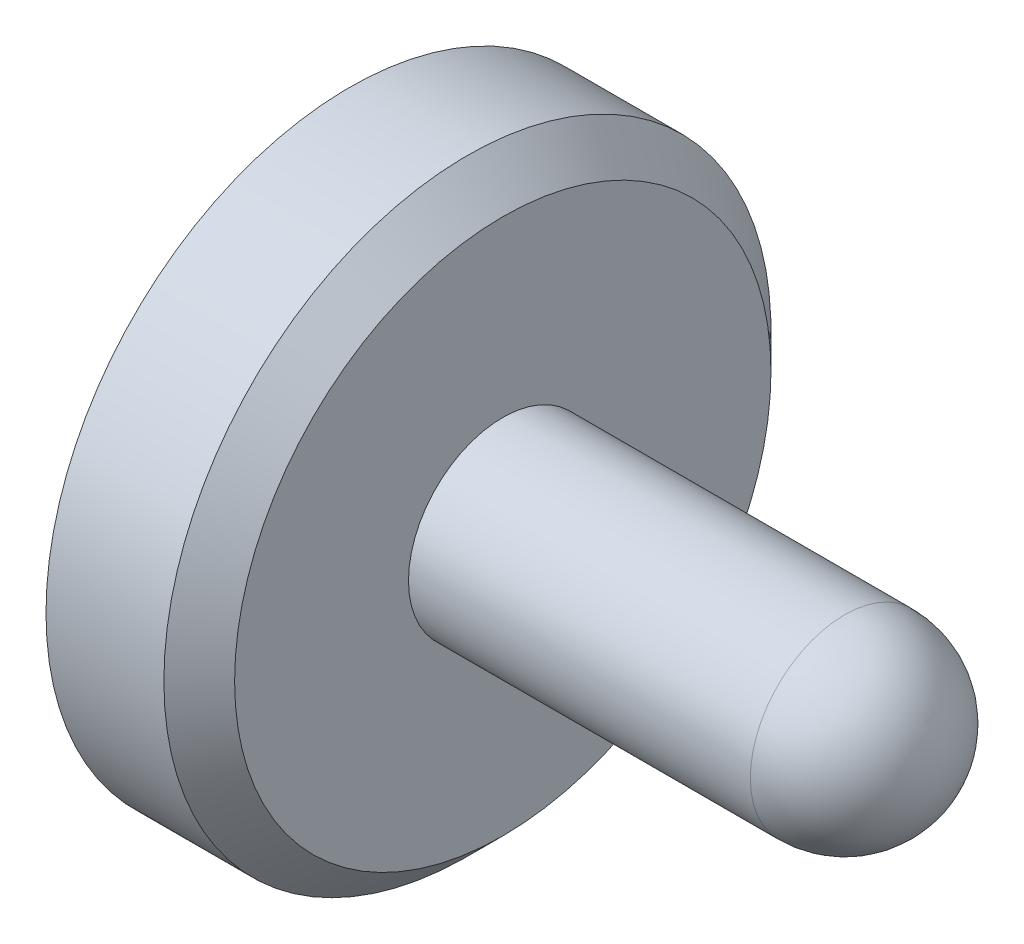
ISO-10303-21;
HEADER;
FILE_DESCRIPTION(('STEP AP214'),'2;1');
FILE_NAME('part.step','',(''),(''),'','','');
FILE_SCHEMA(('AUTOMOTIVE_DESIGN { 1 0 10303 214 1 1 1 1 }'));
ENDSEC;
DATA;
#1=APPLICATION_CONTEXT('core data for automotive mechanical design processes');
#2=APPLICATION_PROTOCOL_DEFINITION('international standard','automotive_design',2000,#1);
#3=PRODUCT_CONTEXT('',#1,'mechanical');
#4=PRODUCT('Part','Part','',(#3));
#5=PRODUCT_RELATED_PRODUCT_CATEGORY('part','',(#4));
#6=PRODUCT_DEFINITION_FORMATION('','',#4);
#7=PRODUCT_DEFINITION_CONTEXT('part definition',#1,'design');
#8=PRODUCT_DEFINITION('design','',#6,#7);
#9=PRODUCT_DEFINITION_SHAPE('','',#8);
#10=(LENGTH_UNIT() NAMED_UNIT(*) SI_UNIT(.MILLI.,.METRE.));
#11=(NAMED_UNIT(*) PLANE_ANGLE_UNIT() SI_UNIT($,.RADIAN.));
#12=(NAMED_UNIT(*) SI_UNIT($,.STERADIAN.) SOLID_ANGLE_UNIT());
#13=UNCERTAINTY_MEASURE_WITH_UNIT(LENGTH_MEASURE(1.E-05),#10,'distance_accuracy_value','');
#14=(GEOMETRIC_REPRESENTATION_CONTEXT(3) GLOBAL_UNCERTAINTY_ASSIGNED_CONTEXT((#13)) GLOBAL_UNIT_ASSIGNED_CONTEXT((#10,
#11,#12)) REPRESENTATION_CONTEXT('',''));
#15=CARTESIAN_POINT('',(0.,0.,0.));
#16=DIRECTION('',(0.,0.,1.));
#17=DIRECTION('',(1.,0.,0.));
#18=AXIS2_PLACEMENT_3D('',#15,#16,#17);
#19=CARTESIAN_POINT('',(1.0668,0.,0.));
#20=DIRECTION('',(-1.,0.,0.));
#21=DIRECTION('',(0.,1.,0.));
#22=AXIS2_PLACEMENT_3D('',#19,#20,#21);
#23=SPHERICAL_SURFACE('',#22,0.2032);
#24=CARTESIAN_POINT('',(1.0668,0.,0.));
#25=DIRECTION('',(-1.,0.,0.));
#26=DIRECTION('',(0.,0.,1.));
#27=AXIS2_PLACEMENT_3D('',#24,#25,#26);
#28=CIRCLE('',#27,0.2032);
#29=CARTESIAN_POINT('',(1.0668,0.,0.2032));
#30=VERTEX_POINT('',#29);
#31=EDGE_CURVE('E10',#30,#30,#28,.T.);
#32=ORIENTED_EDGE('',*,*,#31,.F.);
#33=EDGE_LOOP('',(#32));
#34=FACE_BOUND('',#33,.T.);
#35=ADVANCED_FACE('F30',(#34),#23,.T.);
#36=CARTESIAN_POINT('',(0.,0.,0.));
#37=DIRECTION('',(-1.,0.,0.));
#38=DIRECTION('',(0.,0.,1.));
#39=AXIS2_PLACEMENT_3D('',#36,#37,#38);
#40=CYLINDRICAL_SURFACE('',#39,0.2032);
#41=CARTESIAN_POINT('',(0.330200000000003,0.,0.));
#42=DIRECTION('',(-1.,0.,0.));
#43=DIRECTION('',(0.,0.,1.));
#44=AXIS2_PLACEMENT_3D('',#41,#42,#43);
#45=CIRCLE('',#44,0.2032);
#46=CARTESIAN_POINT('',(0.330200000000003,0.,0.2032));
#47=VERTEX_POINT('',#46);
#48=EDGE_CURVE('E36',#47,#47,#45,.T.);
#49=ORIENTED_EDGE('',*,*,#48,.F.);
#50=EDGE_LOOP('',(#49));
#51=FACE_BOUND('',#50,.T.);
#52=ORIENTED_EDGE('',*,*,#31,.T.);
#53=EDGE_LOOP('',(#52));
#54=FACE_BOUND('',#53,.T.);
#55=ADVANCED_FACE('F69',(#51,#54),#40,.T.);
#56=CARTESIAN_POINT('',(0.330200000000003,0.577850000000017,0.));
#57=DIRECTION('',(-1.,0.,0.));
#58=DIRECTION('',(0.,0.,1.));
#59=AXIS2_PLACEMENT_3D('',#56,#57,#58);
#60=PLANE('',#59);
#61=CARTESIAN_POINT('',(0.330200000000003,0.,0.));
#62=DIRECTION('',(-1.,0.,0.));
#63=DIRECTION('',(0.,0.,1.));
#64=AXIS2_PLACEMENT_3D('',#61,#62,#63);
#65=CIRCLE('',#64,0.577850000000017);
#66=CARTESIAN_POINT('',(0.330200000000003,0.,0.577850000000017));
#67=VERTEX_POINT('',#66);
#68=EDGE_CURVE('E40',#67,#67,#65,.T.);
#69=ORIENTED_EDGE('',*,*,#68,.F.);
#70=EDGE_LOOP('',(#69));
#71=FACE_BOUND('',#70,.T.);
#72=ORIENTED_EDGE('',*,*,#48,.T.);
#73=EDGE_LOOP('',(#72));
#74=FACE_BOUND('',#73,.T.);
#75=ADVANCED_FACE('F64',(#71,#74),#60,.F.);
#76=CARTESIAN_POINT('',(0.330200000000003,0.,0.));
#77=DIRECTION('',(-1.,0.,0.));
#78=DIRECTION('',(0.,0.,1.));
#79=AXIS2_PLACEMENT_3D('',#76,#77,#78);
#80=CONICAL_SURFACE('',#79,0.577850000000017,0.785398163397448);
#81=CARTESIAN_POINT('',(0.254000000000003,0.,0.));
#82=DIRECTION('',(-1.,0.,0.));
#83=DIRECTION('',(0.,0.,1.));
#84=AXIS2_PLACEMENT_3D('',#81,#82,#83);
#85=CIRCLE('',#84,0.654050000000017);
#86=CARTESIAN_POINT('',(0.254000000000003,0.,0.654050000000017));
#87=VERTEX_POINT('',#86);
#88=EDGE_CURVE('E44',#87,#87,#85,.T.);
#89=ORIENTED_EDGE('',*,*,#88,.F.);
#90=EDGE_LOOP('',(#89));
#91=FACE_BOUND('',#90,.T.);
#92=ORIENTED_EDGE('',*,*,#68,.T.);
#93=EDGE_LOOP('',(#92));
#94=FACE_BOUND('',#93,.T.);
#95=ADVANCED_FACE('F58',(#91,#94),#80,.T.);
#96=CARTESIAN_POINT('',(0.,0.,0.));
#97=DIRECTION('',(-1.,0.,0.));
#98=DIRECTION('',(0.,0.,1.));
#99=AXIS2_PLACEMENT_3D('',#96,#97,#98);
#100=CYLINDRICAL_SURFACE('',#99,0.654050000000017);
#101=CARTESIAN_POINT('',(0.,0.,0.));
#102=DIRECTION('',(-1.,0.,0.));
#103=DIRECTION('',(0.,0.,1.));
#104=AXIS2_PLACEMENT_3D('',#101,#102,#103);
#105=CIRCLE('',#104,0.654050000000017);
#106=CARTESIAN_POINT('',(0.,0.,0.654050000000017));
#107=VERTEX_POINT('',#106);
#108=EDGE_CURVE('E49',#107,#107,#105,.T.);
#109=ORIENTED_EDGE('',*,*,#108,.F.);
#110=EDGE_LOOP('',(#109));
#111=FACE_BOUND('',#110,.T.);
#112=ORIENTED_EDGE('',*,*,#88,.T.);
#113=EDGE_LOOP('',(#112));
#114=FACE_BOUND('',#113,.T.);
#115=ADVANCED_FACE('F55',(#111,#114),#100,.T.);
#116=CARTESIAN_POINT('',(0.,0.,0.));
#117=DIRECTION('',(1.,0.,0.));
#118=DIRECTION('',(0.,0.,-1.));
#119=AXIS2_PLACEMENT_3D('',#116,#117,#118);
#120=PLANE('',#119);
#121=ORIENTED_EDGE('',*,*,#108,.T.);
#122=EDGE_LOOP('',(#121));
#123=FACE_BOUND('',#122,.T.);
#124=ADVANCED_FACE('F53',(#123),#120,.F.);
#125=CLOSED_SHELL('',(#35,#55,#75,#95,#115,#124));
#126=MANIFOLD_SOLID_BREP('B2',#125);
#127=ADVANCED_BREP_SHAPE_REPRESENTATION('',(#18,#126),#14);
#128=SHAPE_DEFINITION_REPRESENTATION(#9,#127);
ENDSEC;
END-ISO-10303-21;
